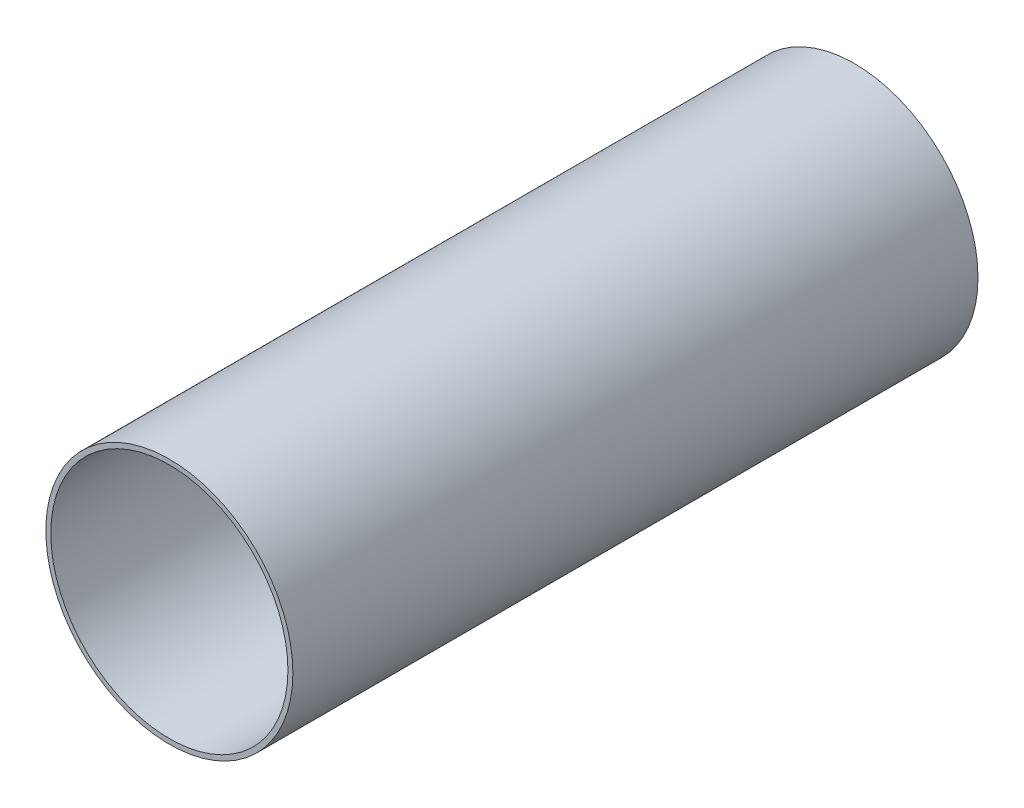
ISO-10303-21;
HEADER;
FILE_DESCRIPTION(('STEP AP214'),'2;1');
FILE_NAME('part.step','',(''),(''),'','','');
FILE_SCHEMA(('AUTOMOTIVE_DESIGN { 1 0 10303 214 1 1 1 1 }'));
ENDSEC;
DATA;
#1=APPLICATION_CONTEXT('core data for automotive mechanical design processes');
#2=APPLICATION_PROTOCOL_DEFINITION('international standard','automotive_design',2000,#1);
#3=PRODUCT_CONTEXT('',#1,'mechanical');
#4=PRODUCT('Part','Part','',(#3));
#5=PRODUCT_RELATED_PRODUCT_CATEGORY('part','',(#4));
#6=PRODUCT_DEFINITION_FORMATION('','',#4);
#7=PRODUCT_DEFINITION_CONTEXT('part definition',#1,'design');
#8=PRODUCT_DEFINITION('design','',#6,#7);
#9=PRODUCT_DEFINITION_SHAPE('','',#8);
#10=(LENGTH_UNIT() NAMED_UNIT(*) SI_UNIT(.MILLI.,.METRE.));
#11=(NAMED_UNIT(*) PLANE_ANGLE_UNIT() SI_UNIT($,.RADIAN.));
#12=(NAMED_UNIT(*) SI_UNIT($,.STERADIAN.) SOLID_ANGLE_UNIT());
#13=UNCERTAINTY_MEASURE_WITH_UNIT(LENGTH_MEASURE(1.E-05),#10,'distance_accuracy_value','');
#14=(GEOMETRIC_REPRESENTATION_CONTEXT(3) GLOBAL_UNCERTAINTY_ASSIGNED_CONTEXT((#13)) GLOBAL_UNIT_ASSIGNED_CONTEXT((#10,
#11,#12)) REPRESENTATION_CONTEXT('',''));
#15=CARTESIAN_POINT('',(0.,0.,0.));
#16=DIRECTION('',(0.,0.,1.));
#17=DIRECTION('',(1.,0.,0.));
#18=AXIS2_PLACEMENT_3D('',#15,#16,#17);
#19=CARTESIAN_POINT('',(0.,0.,220.1418));
#20=DIRECTION('',(0.,0.,1.));
#21=DIRECTION('',(1.,0.,0.));
#22=AXIS2_PLACEMENT_3D('',#19,#20,#21);
#23=PLANE('',#22);
#24=CARTESIAN_POINT('',(0.,0.,220.1418));
#25=DIRECTION('',(0.,0.,1.));
#26=DIRECTION('',(1.,0.,0.));
#27=AXIS2_PLACEMENT_3D('',#24,#25,#26);
#28=CIRCLE('',#27,39.6875);
#29=CARTESIAN_POINT('',(39.6875,0.,220.1418));
#30=VERTEX_POINT('',#29);
#31=EDGE_CURVE('E10',#30,#30,#28,.T.);
#32=ORIENTED_EDGE('',*,*,#31,.T.);
#33=EDGE_LOOP('',(#32));
#34=FACE_BOUND('',#33,.T.);
#35=CARTESIAN_POINT('',(0.,0.,220.1418));
#36=DIRECTION('',(0.,0.,1.));
#37=DIRECTION('',(1.,0.,0.));
#38=AXIS2_PLACEMENT_3D('',#35,#36,#37);
#39=CIRCLE('',#38,38.1);
#40=CARTESIAN_POINT('',(38.1,0.,220.1418));
#41=VERTEX_POINT('',#40);
#42=EDGE_CURVE('E42',#41,#41,#39,.T.);
#43=ORIENTED_EDGE('',*,*,#42,.F.);
#44=EDGE_LOOP('',(#43));
#45=FACE_BOUND('',#44,.T.);
#46=ADVANCED_FACE('F31',(#34,#45),#23,.T.);
#47=CARTESIAN_POINT('',(0.,0.,0.));
#48=DIRECTION('',(0.,0.,1.));
#49=DIRECTION('',(1.,0.,0.));
#50=AXIS2_PLACEMENT_3D('',#47,#48,#49);
#51=PLANE('',#50);
#52=CARTESIAN_POINT('',(0.,0.,0.));
#53=DIRECTION('',(0.,0.,1.));
#54=DIRECTION('',(1.,0.,0.));
#55=AXIS2_PLACEMENT_3D('',#52,#53,#54);
#56=CIRCLE('',#55,39.6875);
#57=CARTESIAN_POINT('',(39.6875,0.,0.));
#58=VERTEX_POINT('',#57);
#59=EDGE_CURVE('E35',#58,#58,#56,.T.);
#60=ORIENTED_EDGE('',*,*,#59,.F.);
#61=EDGE_LOOP('',(#60));
#62=FACE_BOUND('',#61,.T.);
#63=CARTESIAN_POINT('',(0.,0.,0.));
#64=DIRECTION('',(0.,0.,1.));
#65=DIRECTION('',(1.,0.,0.));
#66=AXIS2_PLACEMENT_3D('',#63,#64,#65);
#67=CIRCLE('',#66,38.1);
#68=CARTESIAN_POINT('',(38.1,0.,0.));
#69=VERTEX_POINT('',#68);
#70=EDGE_CURVE('E44',#69,#69,#67,.T.);
#71=ORIENTED_EDGE('',*,*,#70,.T.);
#72=EDGE_LOOP('',(#71));
#73=FACE_BOUND('',#72,.T.);
#74=ADVANCED_FACE('F54',(#62,#73),#51,.F.);
#75=CARTESIAN_POINT('',(0.,0.,220.1418));
#76=DIRECTION('',(0.,0.,-1.));
#77=DIRECTION('',(-1.,0.,0.));
#78=AXIS2_PLACEMENT_3D('',#75,#76,#77);
#79=CYLINDRICAL_SURFACE('',#78,39.6875);
#80=ORIENTED_EDGE('',*,*,#31,.F.);
#81=EDGE_LOOP('',(#80));
#82=FACE_BOUND('',#81,.T.);
#83=ORIENTED_EDGE('',*,*,#59,.T.);
#84=EDGE_LOOP('',(#83));
#85=FACE_BOUND('',#84,.T.);
#86=ADVANCED_FACE('F33',(#82,#85),#79,.T.);
#87=CARTESIAN_POINT('',(0.,0.,220.1418));
#88=DIRECTION('',(0.,0.,-1.));
#89=DIRECTION('',(-1.,0.,0.));
#90=AXIS2_PLACEMENT_3D('',#87,#88,#89);
#91=CYLINDRICAL_SURFACE('',#90,38.1);
#92=ORIENTED_EDGE('',*,*,#42,.T.);
#93=EDGE_LOOP('',(#92));
#94=FACE_BOUND('',#93,.T.);
#95=ORIENTED_EDGE('',*,*,#70,.F.);
#96=EDGE_LOOP('',(#95));
#97=FACE_BOUND('',#96,.T.);
#98=ADVANCED_FACE('F50',(#94,#97),#91,.F.);
#99=CLOSED_SHELL('',(#46,#74,#86,#98));
#100=MANIFOLD_SOLID_BREP('B2',#99);
#101=ADVANCED_BREP_SHAPE_REPRESENTATION('',(#18,#100),#14);
#102=SHAPE_DEFINITION_REPRESENTATION(#9,#101);
ENDSEC;
END-ISO-10303-21;
